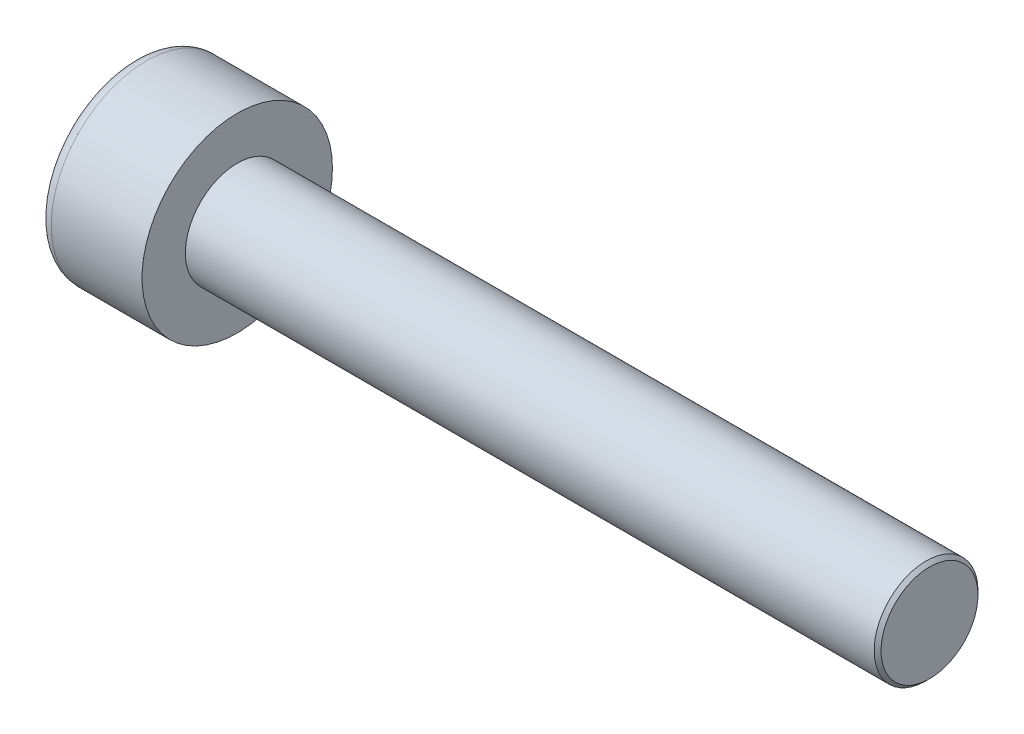
ISO-10303-21;
HEADER;
FILE_DESCRIPTION(('STEP AP214'),'2;1');
FILE_NAME('part.step','',(''),(''),'','','');
FILE_SCHEMA(('AUTOMOTIVE_DESIGN { 1 0 10303 214 1 1 1 1 }'));
ENDSEC;
DATA;
#1=APPLICATION_CONTEXT('core data for automotive mechanical design processes');
#2=APPLICATION_PROTOCOL_DEFINITION('international standard','automotive_design',2000,#1);
#3=PRODUCT_CONTEXT('',#1,'mechanical');
#4=PRODUCT('Part','Part','',(#3));
#5=PRODUCT_RELATED_PRODUCT_CATEGORY('part','',(#4));
#6=PRODUCT_DEFINITION_FORMATION('','',#4);
#7=PRODUCT_DEFINITION_CONTEXT('part definition',#1,'design');
#8=PRODUCT_DEFINITION('design','',#6,#7);
#9=PRODUCT_DEFINITION_SHAPE('','',#8);
#10=(LENGTH_UNIT() NAMED_UNIT(*) SI_UNIT(.MILLI.,.METRE.));
#11=(NAMED_UNIT(*) PLANE_ANGLE_UNIT() SI_UNIT($,.RADIAN.));
#12=(NAMED_UNIT(*) SI_UNIT($,.STERADIAN.) SOLID_ANGLE_UNIT());
#13=UNCERTAINTY_MEASURE_WITH_UNIT(LENGTH_MEASURE(1.E-05),#10,'distance_accuracy_value','');
#14=(GEOMETRIC_REPRESENTATION_CONTEXT(3) GLOBAL_UNCERTAINTY_ASSIGNED_CONTEXT((#13)) GLOBAL_UNIT_ASSIGNED_CONTEXT((#10,
#11,#12)) REPRESENTATION_CONTEXT('',''));
#15=CARTESIAN_POINT('',(0.,0.,0.));
#16=DIRECTION('',(0.,0.,1.));
#17=DIRECTION('',(1.,0.,0.));
#18=AXIS2_PLACEMENT_3D('',#15,#16,#17);
#19=CARTESIAN_POINT('',(1.3,-2.5,0.));
#20=DIRECTION('',(-1.,0.,0.));
#21=DIRECTION('',(0.,0.,1.));
#22=AXIS2_PLACEMENT_3D('',#19,#20,#21);
#23=PLANE('',#22);
#24=DIRECTION('',(0.,-0.866025403784438,-0.5));
#25=VECTOR('',#24,1.);
#26=CARTESIAN_POINT('',(1.3,0.,1.44337567297406));
#27=LINE('',#26,#25);
#28=CARTESIAN_POINT('',(1.3,-0.625,1.08253175473055));
#29=VERTEX_POINT('',#28);
#30=CARTESIAN_POINT('',(1.3,-1.25,0.721687836487031));
#31=VERTEX_POINT('',#30);
#32=EDGE_CURVE('E165',#29,#31,#27,.T.);
#33=ORIENTED_EDGE('',*,*,#32,.F.);
#34=CARTESIAN_POINT('',(1.3,0.,0.));
#35=DIRECTION('',(-1.,0.,0.));
#36=DIRECTION('',(0.,0.,1.));
#37=AXIS2_PLACEMENT_3D('',#34,#35,#36);
#38=CIRCLE('',#37,1.25);
#39=CARTESIAN_POINT('',(1.3,-1.25,0.));
#40=VERTEX_POINT('',#39);
#41=EDGE_CURVE('E60',#29,#40,#38,.F.);
#42=ORIENTED_EDGE('',*,*,#41,.T.);
#43=DIRECTION('',(0.,0.,-1.));
#44=VECTOR('',#43,1.);
#45=CARTESIAN_POINT('',(1.3,-1.25,0.721687836487031));
#46=LINE('',#45,#44);
#47=EDGE_CURVE('E170',#31,#40,#46,.T.);
#48=ORIENTED_EDGE('',*,*,#47,.F.);
#49=EDGE_LOOP('',(#33,#42,#48));
#50=FACE_BOUND('',#49,.T.);
#51=ADVANCED_FACE('F45',(#50),#23,.T.);
#52=CARTESIAN_POINT('',(1.3,-1.25,-0.721687836487036));
#53=VERTEX_POINT('',#52);
#54=EDGE_CURVE('E169',#40,#53,#46,.T.);
#55=ORIENTED_EDGE('',*,*,#54,.F.);
#56=CARTESIAN_POINT('',(1.3,-0.625,-1.08253175473055));
#57=VERTEX_POINT('',#56);
#58=EDGE_CURVE('E145',#40,#57,#38,.F.);
#59=ORIENTED_EDGE('',*,*,#58,.T.);
#60=DIRECTION('',(0.,0.866025403784439,-0.5));
#61=VECTOR('',#60,1.);
#62=CARTESIAN_POINT('',(1.3,-1.25,-0.721687836487036));
#63=LINE('',#62,#61);
#64=EDGE_CURVE('E153',#53,#57,#63,.T.);
#65=ORIENTED_EDGE('',*,*,#64,.F.);
#66=EDGE_LOOP('',(#55,#59,#65));
#67=FACE_BOUND('',#66,.T.);
#68=ADVANCED_FACE('F226',(#67),#23,.T.);
#69=CARTESIAN_POINT('',(1.3,0.,-1.44337567297407));
#70=VERTEX_POINT('',#69);
#71=EDGE_CURVE('E143',#57,#70,#63,.T.);
#72=ORIENTED_EDGE('',*,*,#71,.F.);
#73=CARTESIAN_POINT('',(1.3,0.624999999999999,-1.08253175473055));
#74=VERTEX_POINT('',#73);
#75=EDGE_CURVE('E127',#57,#74,#38,.F.);
#76=ORIENTED_EDGE('',*,*,#75,.T.);
#77=DIRECTION('',(0.,0.866025403784439,0.5));
#78=VECTOR('',#77,1.);
#79=CARTESIAN_POINT('',(1.3,0.,-1.44337567297407));
#80=LINE('',#79,#78);
#81=EDGE_CURVE('E141',#70,#74,#80,.T.);
#82=ORIENTED_EDGE('',*,*,#81,.F.);
#83=EDGE_LOOP('',(#72,#76,#82));
#84=FACE_BOUND('',#83,.T.);
#85=ADVANCED_FACE('F139',(#84),#23,.T.);
#86=CARTESIAN_POINT('',(1.3,1.25,-0.721687836487031));
#87=VERTEX_POINT('',#86);
#88=EDGE_CURVE('E147',#74,#87,#80,.T.);
#89=ORIENTED_EDGE('',*,*,#88,.F.);
#90=CARTESIAN_POINT('',(1.3,0.,0.));
#91=DIRECTION('',(1.,0.,0.));
#92=DIRECTION('',(0.,0.,-1.));
#93=AXIS2_PLACEMENT_3D('',#90,#91,#92);
#94=CIRCLE('',#93,1.25);
#95=CARTESIAN_POINT('',(1.3,1.25,0.));
#96=VERTEX_POINT('',#95);
#97=EDGE_CURVE('E125',#74,#96,#94,.T.);
#98=ORIENTED_EDGE('',*,*,#97,.T.);
#99=DIRECTION('',(0.,0.,1.));
#100=VECTOR('',#99,1.);
#101=CARTESIAN_POINT('',(1.3,1.25,-0.721687836487031));
#102=LINE('',#101,#100);
#103=EDGE_CURVE('E150',#87,#96,#102,.T.);
#104=ORIENTED_EDGE('',*,*,#103,.F.);
#105=EDGE_LOOP('',(#89,#98,#104));
#106=FACE_BOUND('',#105,.T.);
#107=ADVANCED_FACE('F148',(#106),#23,.T.);
#108=CARTESIAN_POINT('',(1.3,1.25,0.721687836487031));
#109=VERTEX_POINT('',#108);
#110=EDGE_CURVE('E157',#96,#109,#102,.T.);
#111=ORIENTED_EDGE('',*,*,#110,.F.);
#112=CARTESIAN_POINT('',(1.3,0.625,1.08253175473055));
#113=VERTEX_POINT('',#112);
#114=EDGE_CURVE('E130',#96,#113,#38,.F.);
#115=ORIENTED_EDGE('',*,*,#114,.T.);
#116=DIRECTION('',(0.,-0.866025403784438,0.5));
#117=VECTOR('',#116,1.);
#118=CARTESIAN_POINT('',(1.3,1.25,0.721687836487031));
#119=LINE('',#118,#117);
#120=EDGE_CURVE('E162',#109,#113,#119,.T.);
#121=ORIENTED_EDGE('',*,*,#120,.F.);
#122=EDGE_LOOP('',(#111,#115,#121));
#123=FACE_BOUND('',#122,.T.);
#124=ADVANCED_FACE('F238',(#123),#23,.T.);
#125=CARTESIAN_POINT('',(1.3,0.,1.44337567297406));
#126=VERTEX_POINT('',#125);
#127=EDGE_CURVE('E161',#113,#126,#119,.T.);
#128=ORIENTED_EDGE('',*,*,#127,.F.);
#129=EDGE_CURVE('E206',#113,#29,#38,.F.);
#130=ORIENTED_EDGE('',*,*,#129,.T.);
#131=EDGE_CURVE('E166',#126,#29,#27,.T.);
#132=ORIENTED_EDGE('',*,*,#131,.F.);
#133=EDGE_LOOP('',(#128,#130,#132));
#134=FACE_BOUND('',#133,.T.);
#135=ADVANCED_FACE('F229',(#134),#23,.T.);
#136=CARTESIAN_POINT('',(0.,0.,0.));
#137=DIRECTION('',(1.,0.,0.));
#138=DIRECTION('',(0.,0.,-1.));
#139=AXIS2_PLACEMENT_3D('',#136,#137,#138);
#140=PLANE('',#139);
#141=CARTESIAN_POINT('',(0.,0.,0.));
#142=DIRECTION('',(1.,0.,0.));
#143=DIRECTION('',(0.,0.,-1.));
#144=AXIS2_PLACEMENT_3D('',#141,#142,#143);
#145=CIRCLE('',#144,2.375);
#146=CARTESIAN_POINT('',(0.,0.,-2.375));
#147=VERTEX_POINT('',#146);
#148=EDGE_CURVE('E211',#147,#147,#145,.F.);
#149=ORIENTED_EDGE('',*,*,#148,.T.);
#150=EDGE_LOOP('',(#149));
#151=FACE_BOUND('',#150,.T.);
#152=DIRECTION('',(0.,0.866025403784439,-0.5));
#153=VECTOR('',#152,1.);
#154=CARTESIAN_POINT('',(0.,-1.25,-0.721687836487036));
#155=LINE('',#154,#153);
#156=CARTESIAN_POINT('',(0.,-1.25,-0.721687836487036));
#157=VERTEX_POINT('',#156);
#158=CARTESIAN_POINT('',(0.,0.,-1.44337567297407));
#159=VERTEX_POINT('',#158);
#160=EDGE_CURVE('E68',#157,#159,#155,.T.);
#161=ORIENTED_EDGE('',*,*,#160,.T.);
#162=DIRECTION('',(0.,0.866025403784439,0.5));
#163=VECTOR('',#162,1.);
#164=CARTESIAN_POINT('',(0.,0.,-1.44337567297407));
#165=LINE('',#164,#163);
#166=CARTESIAN_POINT('',(0.,1.25,-0.721687836487031));
#167=VERTEX_POINT('',#166);
#168=EDGE_CURVE('E175',#159,#167,#165,.T.);
#169=ORIENTED_EDGE('',*,*,#168,.T.);
#170=DIRECTION('',(0.,0.,1.));
#171=VECTOR('',#170,1.);
#172=CARTESIAN_POINT('',(0.,1.25,-0.721687836487031));
#173=LINE('',#172,#171);
#174=CARTESIAN_POINT('',(0.,1.25,0.721687836487031));
#175=VERTEX_POINT('',#174);
#176=EDGE_CURVE('E178',#167,#175,#173,.T.);
#177=ORIENTED_EDGE('',*,*,#176,.T.);
#178=DIRECTION('',(0.,-0.866025403784438,0.5));
#179=VECTOR('',#178,1.);
#180=CARTESIAN_POINT('',(0.,1.25,0.721687836487031));
#181=LINE('',#180,#179);
#182=CARTESIAN_POINT('',(0.,0.,1.44337567297406));
#183=VERTEX_POINT('',#182);
#184=EDGE_CURVE('E181',#175,#183,#181,.T.);
#185=ORIENTED_EDGE('',*,*,#184,.T.);
#186=DIRECTION('',(0.,-0.866025403784438,-0.5));
#187=VECTOR('',#186,1.);
#188=CARTESIAN_POINT('',(0.,0.,1.44337567297406));
#189=LINE('',#188,#187);
#190=CARTESIAN_POINT('',(0.,-1.25,0.721687836487031));
#191=VERTEX_POINT('',#190);
#192=EDGE_CURVE('E184',#183,#191,#189,.T.);
#193=ORIENTED_EDGE('',*,*,#192,.T.);
#194=DIRECTION('',(0.,0.,-1.));
#195=VECTOR('',#194,1.);
#196=CARTESIAN_POINT('',(0.,-1.25,0.721687836487031));
#197=LINE('',#196,#195);
#198=EDGE_CURVE('E187',#191,#157,#197,.T.);
#199=ORIENTED_EDGE('',*,*,#198,.T.);
#200=EDGE_LOOP('',(#161,#169,#177,#185,#193,#199));
#201=FACE_BOUND('',#200,.T.);
#202=ADVANCED_FACE('F237',(#151,#201),#140,.F.);
#203=CARTESIAN_POINT('',(3.,0.,0.));
#204=DIRECTION('',(1.,0.,0.));
#205=DIRECTION('',(0.,0.,-1.));
#206=AXIS2_PLACEMENT_3D('',#203,#204,#205);
#207=PLANE('',#206);
#208=CARTESIAN_POINT('',(3.,0.,0.));
#209=DIRECTION('',(1.,0.,0.));
#210=DIRECTION('',(0.,0.,-1.));
#211=AXIS2_PLACEMENT_3D('',#208,#209,#210);
#212=CIRCLE('',#211,2.75);
#213=CARTESIAN_POINT('',(3.,0.,-2.75));
#214=VERTEX_POINT('',#213);
#215=EDGE_CURVE('E203',#214,#214,#212,.T.);
#216=ORIENTED_EDGE('',*,*,#215,.T.);
#217=EDGE_LOOP('',(#216));
#218=FACE_BOUND('',#217,.T.);
#219=CARTESIAN_POINT('',(3.,0.,0.));
#220=DIRECTION('',(1.,0.,0.));
#221=DIRECTION('',(0.,0.,-1.));
#222=AXIS2_PLACEMENT_3D('',#219,#220,#221);
#223=CIRCLE('',#222,1.5);
#224=CARTESIAN_POINT('',(3.,0.,-1.5));
#225=VERTEX_POINT('',#224);
#226=EDGE_CURVE('E200',#225,#225,#223,.T.);
#227=ORIENTED_EDGE('',*,*,#226,.F.);
#228=EDGE_LOOP('',(#227));
#229=FACE_BOUND('',#228,.T.);
#230=ADVANCED_FACE('F244',(#218,#229),#207,.T.);
#231=CARTESIAN_POINT('',(3.,0.,0.));
#232=DIRECTION('',(-1.,0.,0.));
#233=DIRECTION('',(0.,0.,1.));
#234=AXIS2_PLACEMENT_3D('',#231,#232,#233);
#235=CYLINDRICAL_SURFACE('',#234,2.75);
#236=CARTESIAN_POINT('',(0.375,0.,0.));
#237=DIRECTION('',(1.,0.,0.));
#238=DIRECTION('',(0.,0.,-1.));
#239=AXIS2_PLACEMENT_3D('',#236,#237,#238);
#240=CIRCLE('',#239,2.75);
#241=CARTESIAN_POINT('',(0.375,0.,-2.75));
#242=VERTEX_POINT('',#241);
#243=EDGE_CURVE('E208',#242,#242,#240,.T.);
#244=ORIENTED_EDGE('',*,*,#243,.T.);
#245=EDGE_LOOP('',(#244));
#246=FACE_BOUND('',#245,.T.);
#247=ORIENTED_EDGE('',*,*,#215,.F.);
#248=EDGE_LOOP('',(#247));
#249=FACE_BOUND('',#248,.T.);
#250=ADVANCED_FACE('F289',(#246,#249),#235,.T.);
#251=CARTESIAN_POINT('',(23.,0.,0.));
#252=DIRECTION('',(-1.,0.,0.));
#253=DIRECTION('',(0.,0.,1.));
#254=AXIS2_PLACEMENT_3D('',#251,#252,#253);
#255=CYLINDRICAL_SURFACE('',#254,1.5);
#256=CARTESIAN_POINT('',(22.9,0.,0.));
#257=DIRECTION('',(1.,0.,0.));
#258=DIRECTION('',(0.,0.,-1.));
#259=AXIS2_PLACEMENT_3D('',#256,#257,#258);
#260=CIRCLE('',#259,1.5);
#261=CARTESIAN_POINT('',(22.9,0.,-1.5));
#262=VERTEX_POINT('',#261);
#263=EDGE_CURVE('E11',#262,#262,#260,.F.);
#264=ORIENTED_EDGE('',*,*,#263,.T.);
#265=EDGE_LOOP('',(#264));
#266=FACE_BOUND('',#265,.T.);
#267=ORIENTED_EDGE('',*,*,#226,.T.);
#268=EDGE_LOOP('',(#267));
#269=FACE_BOUND('',#268,.T.);
#270=ADVANCED_FACE('F286',(#266,#269),#255,.T.);
#271=CARTESIAN_POINT('',(23.,0.,0.));
#272=DIRECTION('',(1.,0.,0.));
#273=DIRECTION('',(0.,0.,-1.));
#274=AXIS2_PLACEMENT_3D('',#271,#272,#273);
#275=PLANE('',#274);
#276=CARTESIAN_POINT('',(23.,0.,0.));
#277=DIRECTION('',(1.,0.,0.));
#278=DIRECTION('',(0.,0.,-1.));
#279=AXIS2_PLACEMENT_3D('',#276,#277,#278);
#280=CIRCLE('',#279,1.40000000000001);
#281=CARTESIAN_POINT('',(23.,0.,-1.40000000000001));
#282=VERTEX_POINT('',#281);
#283=EDGE_CURVE('E53',#282,#282,#280,.T.);
#284=ORIENTED_EDGE('',*,*,#283,.T.);
#285=EDGE_LOOP('',(#284));
#286=FACE_BOUND('',#285,.T.);
#287=ADVANCED_FACE('F216',(#286),#275,.T.);
#288=CARTESIAN_POINT('',(1.3,-1.25,-0.721687836487036));
#289=DIRECTION('',(0.,0.5,0.866025403784439));
#290=DIRECTION('',(0.,-0.866025403784439,0.5));
#291=AXIS2_PLACEMENT_3D('',#288,#289,#290);
#292=PLANE('',#291);
#293=ORIENTED_EDGE('',*,*,#160,.F.);
#294=DIRECTION('',(-1.,0.,0.));
#295=VECTOR('',#294,1.);
#296=CARTESIAN_POINT('',(1.3,-1.25,-0.721687836487036));
#297=LINE('',#296,#295);
#298=EDGE_CURVE('E173',#53,#157,#297,.T.);
#299=ORIENTED_EDGE('',*,*,#298,.F.);
#300=ORIENTED_EDGE('',*,*,#64,.T.);
#301=ORIENTED_EDGE('',*,*,#71,.T.);
#302=DIRECTION('',(-1.,0.,0.));
#303=VECTOR('',#302,1.);
#304=CARTESIAN_POINT('',(1.3,0.,-1.44337567297407));
#305=LINE('',#304,#303);
#306=EDGE_CURVE('E156',#70,#159,#305,.T.);
#307=ORIENTED_EDGE('',*,*,#306,.T.);
#308=EDGE_LOOP('',(#293,#299,#300,#301,#307));
#309=FACE_BOUND('',#308,.T.);
#310=ADVANCED_FACE('F260',(#309),#292,.T.);
#311=CARTESIAN_POINT('',(1.3,0.,-1.44337567297407));
#312=DIRECTION('',(0.,-0.5,0.866025403784439));
#313=DIRECTION('',(0.,-0.866025403784439,-0.5));
#314=AXIS2_PLACEMENT_3D('',#311,#312,#313);
#315=PLANE('',#314);
#316=ORIENTED_EDGE('',*,*,#168,.F.);
#317=ORIENTED_EDGE('',*,*,#306,.F.);
#318=ORIENTED_EDGE('',*,*,#81,.T.);
#319=ORIENTED_EDGE('',*,*,#88,.T.);
#320=DIRECTION('',(-1.,0.,0.));
#321=VECTOR('',#320,1.);
#322=CARTESIAN_POINT('',(1.3,1.25,-0.721687836487031));
#323=LINE('',#322,#321);
#324=EDGE_CURVE('E197',#87,#167,#323,.T.);
#325=ORIENTED_EDGE('',*,*,#324,.T.);
#326=EDGE_LOOP('',(#316,#317,#318,#319,#325));
#327=FACE_BOUND('',#326,.T.);
#328=ADVANCED_FACE('F155',(#327),#315,.T.);
#329=CARTESIAN_POINT('',(1.3,1.25,-0.721687836487031));
#330=DIRECTION('',(0.,-1.,0.));
#331=DIRECTION('',(0.,0.,-1.));
#332=AXIS2_PLACEMENT_3D('',#329,#330,#331);
#333=PLANE('',#332);
#334=ORIENTED_EDGE('',*,*,#176,.F.);
#335=ORIENTED_EDGE('',*,*,#324,.F.);
#336=ORIENTED_EDGE('',*,*,#103,.T.);
#337=ORIENTED_EDGE('',*,*,#110,.T.);
#338=DIRECTION('',(-1.,0.,0.));
#339=VECTOR('',#338,1.);
#340=CARTESIAN_POINT('',(1.3,1.25,0.721687836487031));
#341=LINE('',#340,#339);
#342=EDGE_CURVE('E195',#109,#175,#341,.T.);
#343=ORIENTED_EDGE('',*,*,#342,.T.);
#344=EDGE_LOOP('',(#334,#335,#336,#337,#343));
#345=FACE_BOUND('',#344,.T.);
#346=ADVANCED_FACE('F258',(#345),#333,.T.);
#347=CARTESIAN_POINT('',(1.3,1.25,0.721687836487031));
#348=DIRECTION('',(0.,-0.5,-0.866025403784438));
#349=DIRECTION('',(0.,0.866025403784439,-0.5));
#350=AXIS2_PLACEMENT_3D('',#347,#348,#349);
#351=PLANE('',#350);
#352=ORIENTED_EDGE('',*,*,#184,.F.);
#353=ORIENTED_EDGE('',*,*,#342,.F.);
#354=ORIENTED_EDGE('',*,*,#120,.T.);
#355=ORIENTED_EDGE('',*,*,#127,.T.);
#356=DIRECTION('',(-1.,0.,0.));
#357=VECTOR('',#356,1.);
#358=CARTESIAN_POINT('',(1.3,0.,1.44337567297406));
#359=LINE('',#358,#357);
#360=EDGE_CURVE('E193',#126,#183,#359,.T.);
#361=ORIENTED_EDGE('',*,*,#360,.T.);
#362=EDGE_LOOP('',(#352,#353,#354,#355,#361));
#363=FACE_BOUND('',#362,.T.);
#364=ADVANCED_FACE('F255',(#363),#351,.T.);
#365=CARTESIAN_POINT('',(1.3,0.,1.44337567297406));
#366=DIRECTION('',(0.,0.5,-0.866025403784438));
#367=DIRECTION('',(0.,0.866025403784438,0.5));
#368=AXIS2_PLACEMENT_3D('',#365,#366,#367);
#369=PLANE('',#368);
#370=ORIENTED_EDGE('',*,*,#192,.F.);
#371=ORIENTED_EDGE('',*,*,#360,.F.);
#372=ORIENTED_EDGE('',*,*,#131,.T.);
#373=ORIENTED_EDGE('',*,*,#32,.T.);
#374=DIRECTION('',(-1.,0.,0.));
#375=VECTOR('',#374,1.);
#376=CARTESIAN_POINT('',(1.3,-1.25,0.721687836487031));
#377=LINE('',#376,#375);
#378=EDGE_CURVE('E191',#31,#191,#377,.T.);
#379=ORIENTED_EDGE('',*,*,#378,.T.);
#380=EDGE_LOOP('',(#370,#371,#372,#373,#379));
#381=FACE_BOUND('',#380,.T.);
#382=ADVANCED_FACE('F269',(#381),#369,.T.);
#383=CARTESIAN_POINT('',(1.3,-1.25,0.721687836487031));
#384=DIRECTION('',(0.,1.,0.));
#385=DIRECTION('',(0.,0.,1.));
#386=AXIS2_PLACEMENT_3D('',#383,#384,#385);
#387=PLANE('',#386);
#388=ORIENTED_EDGE('',*,*,#198,.F.);
#389=ORIENTED_EDGE('',*,*,#378,.F.);
#390=ORIENTED_EDGE('',*,*,#47,.T.);
#391=ORIENTED_EDGE('',*,*,#54,.T.);
#392=ORIENTED_EDGE('',*,*,#298,.T.);
#393=EDGE_LOOP('',(#388,#389,#390,#391,#392));
#394=FACE_BOUND('',#393,.T.);
#395=ADVANCED_FACE('F122',(#394),#387,.T.);
#396=CARTESIAN_POINT('',(1.3,0.,0.));
#397=DIRECTION('',(-1.,0.,0.));
#398=DIRECTION('',(0.,0.,1.));
#399=AXIS2_PLACEMENT_3D('',#396,#397,#398);
#400=CONICAL_SURFACE('',#399,1.25,1.04719755119659);
#401=CARTESIAN_POINT('',(2.02168783648704,0.,0.));
#402=VERTEX_POINT('',#401);
#403=VERTEX_LOOP('',#402);
#404=FACE_BOUND('',#403,.T.);
#405=ORIENTED_EDGE('',*,*,#97,.F.);
#406=ORIENTED_EDGE('',*,*,#75,.F.);
#407=ORIENTED_EDGE('',*,*,#58,.F.);
#408=ORIENTED_EDGE('',*,*,#41,.F.);
#409=ORIENTED_EDGE('',*,*,#129,.F.);
#410=ORIENTED_EDGE('',*,*,#114,.F.);
#411=EDGE_LOOP('',(#405,#406,#407,#408,#409,#410));
#412=FACE_BOUND('',#411,.T.);
#413=ADVANCED_FACE('F119',(#404,#412),#400,.F.);
#414=CARTESIAN_POINT('',(0.375,0.,0.));
#415=DIRECTION('',(1.,0.,0.));
#416=DIRECTION('',(0.,0.,-1.));
#417=AXIS2_PLACEMENT_3D('',#414,#415,#416);
#418=TOROIDAL_SURFACE('',#417,2.375,0.375);
#419=ORIENTED_EDGE('',*,*,#148,.F.);
#420=EDGE_LOOP('',(#419));
#421=FACE_BOUND('',#420,.T.);
#422=ORIENTED_EDGE('',*,*,#243,.F.);
#423=EDGE_LOOP('',(#422));
#424=FACE_BOUND('',#423,.T.);
#425=ADVANCED_FACE('F121',(#421,#424),#418,.T.);
#426=CARTESIAN_POINT('',(23.,0.,0.));
#427=DIRECTION('',(-1.,0.,0.));
#428=DIRECTION('',(0.,0.,1.));
#429=AXIS2_PLACEMENT_3D('',#426,#427,#428);
#430=CONICAL_SURFACE('',#429,1.40000000000001,0.785398163397445);
#431=ORIENTED_EDGE('',*,*,#263,.F.);
#432=EDGE_LOOP('',(#431));
#433=FACE_BOUND('',#432,.T.);
#434=ORIENTED_EDGE('',*,*,#283,.F.);
#435=EDGE_LOOP('',(#434));
#436=FACE_BOUND('',#435,.T.);
#437=ADVANCED_FACE('F47',(#433,#436),#430,.T.);
#438=CLOSED_SHELL('',(#51,#68,#85,#107,#124,#135,#202,#230,#250,#270,#287,#310,#328,#346,#364,
#382,#395,#413,#425,#437));
#439=MANIFOLD_SOLID_BREP('B2',#438);
#440=ADVANCED_BREP_SHAPE_REPRESENTATION('',(#18,#439),#14);
#441=SHAPE_DEFINITION_REPRESENTATION(#9,#440);
ENDSEC;
END-ISO-10303-21;
